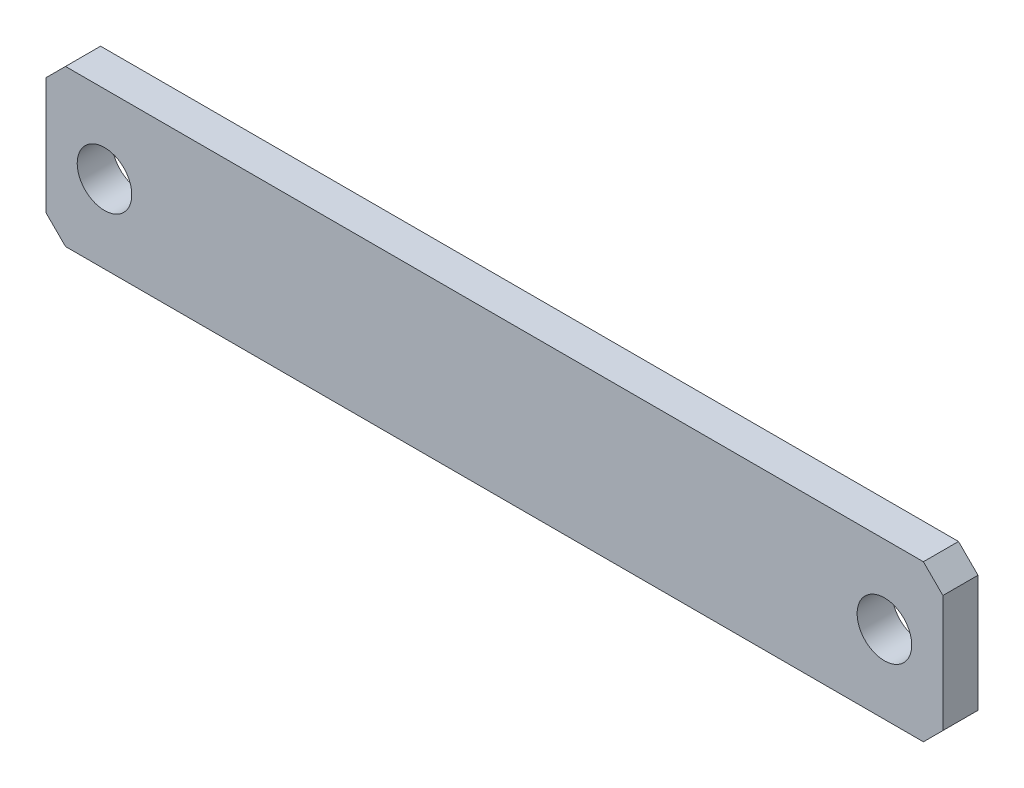
ISO-10303-21;
HEADER;
FILE_DESCRIPTION(('STEP AP214'),'2;1');
FILE_NAME('part.step','',(''),(''),'','','');
FILE_SCHEMA(('AUTOMOTIVE_DESIGN { 1 0 10303 214 1 1 1 1 }'));
ENDSEC;
DATA;
#1=APPLICATION_CONTEXT('core data for automotive mechanical design processes');
#2=APPLICATION_PROTOCOL_DEFINITION('international standard','automotive_design',2000,#1);
#3=PRODUCT_CONTEXT('',#1,'mechanical');
#4=PRODUCT('Part','Part','',(#3));
#5=PRODUCT_RELATED_PRODUCT_CATEGORY('part','',(#4));
#6=PRODUCT_DEFINITION_FORMATION('','',#4);
#7=PRODUCT_DEFINITION_CONTEXT('part definition',#1,'design');
#8=PRODUCT_DEFINITION('design','',#6,#7);
#9=PRODUCT_DEFINITION_SHAPE('','',#8);
#10=(LENGTH_UNIT() NAMED_UNIT(*) SI_UNIT(.MILLI.,.METRE.));
#11=(NAMED_UNIT(*) PLANE_ANGLE_UNIT() SI_UNIT($,.RADIAN.));
#12=(NAMED_UNIT(*) SI_UNIT($,.STERADIAN.) SOLID_ANGLE_UNIT());
#13=UNCERTAINTY_MEASURE_WITH_UNIT(LENGTH_MEASURE(1.E-05),#10,'distance_accuracy_value','');
#14=(GEOMETRIC_REPRESENTATION_CONTEXT(3) GLOBAL_UNCERTAINTY_ASSIGNED_CONTEXT((#13)) GLOBAL_UNIT_ASSIGNED_CONTEXT((#10,
#11,#12)) REPRESENTATION_CONTEXT('',''));
#15=CARTESIAN_POINT('',(0.,0.,0.));
#16=DIRECTION('',(0.,0.,1.));
#17=DIRECTION('',(1.,0.,0.));
#18=AXIS2_PLACEMENT_3D('',#15,#16,#17);
#19=CARTESIAN_POINT('',(0.,0.,0.));
#20=DIRECTION('',(0.,0.,-1.));
#21=DIRECTION('',(-1.,0.,0.));
#22=AXIS2_PLACEMENT_3D('',#19,#20,#21);
#23=PLANE('',#22);
#24=CARTESIAN_POINT('',(100.,0.,0.));
#25=DIRECTION('',(0.,0.,-1.));
#26=DIRECTION('',(-1.,0.,0.));
#27=AXIS2_PLACEMENT_3D('',#24,#25,#26);
#28=CIRCLE('',#27,7.00000000000001);
#29=CARTESIAN_POINT('',(93.,0.,0.));
#30=VERTEX_POINT('',#29);
#31=EDGE_CURVE('E106',#30,#30,#28,.F.);
#32=ORIENTED_EDGE('',*,*,#31,.T.);
#33=EDGE_LOOP('',(#32));
#34=FACE_BOUND('',#33,.T.);
#35=DIRECTION('',(-0.707106781186539,0.707106781186556,0.));
#36=VECTOR('',#35,1.);
#37=CARTESIAN_POINT('',(-115.,-15.,0.));
#38=LINE('',#37,#36);
#39=CARTESIAN_POINT('',(-110.,-20.,0.));
#40=VERTEX_POINT('',#39);
#41=CARTESIAN_POINT('',(-115.,-15.,0.));
#42=VERTEX_POINT('',#41);
#43=EDGE_CURVE('E125',#40,#42,#38,.T.);
#44=ORIENTED_EDGE('',*,*,#43,.T.);
#45=DIRECTION('',(0.,1.,0.));
#46=VECTOR('',#45,1.);
#47=CARTESIAN_POINT('',(-115.,-15.,0.));
#48=LINE('',#47,#46);
#49=CARTESIAN_POINT('',(-115.,15.,0.));
#50=VERTEX_POINT('',#49);
#51=EDGE_CURVE('E120',#42,#50,#48,.T.);
#52=ORIENTED_EDGE('',*,*,#51,.T.);
#53=DIRECTION('',(0.707106781186539,0.707106781186556,0.));
#54=VECTOR('',#53,1.);
#55=CARTESIAN_POINT('',(-115.,15.,0.));
#56=LINE('',#55,#54);
#57=CARTESIAN_POINT('',(-110.,20.,0.));
#58=VERTEX_POINT('',#57);
#59=EDGE_CURVE('E84',#50,#58,#56,.T.);
#60=ORIENTED_EDGE('',*,*,#59,.T.);
#61=DIRECTION('',(1.,0.,0.));
#62=VECTOR('',#61,1.);
#63=CARTESIAN_POINT('',(-110.,20.,0.));
#64=LINE('',#63,#62);
#65=CARTESIAN_POINT('',(110.,20.,0.));
#66=VERTEX_POINT('',#65);
#67=EDGE_CURVE('E82',#58,#66,#64,.T.);
#68=ORIENTED_EDGE('',*,*,#67,.T.);
#69=DIRECTION('',(0.707106781186556,-0.707106781186539,0.));
#70=VECTOR('',#69,1.);
#71=CARTESIAN_POINT('',(110.,20.,0.));
#72=LINE('',#71,#70);
#73=CARTESIAN_POINT('',(115.,15.,0.));
#74=VERTEX_POINT('',#73);
#75=EDGE_CURVE('E79',#66,#74,#72,.T.);
#76=ORIENTED_EDGE('',*,*,#75,.T.);
#77=DIRECTION('',(0.,1.,0.));
#78=VECTOR('',#77,1.);
#79=CARTESIAN_POINT('',(115.,15.,0.));
#80=LINE('',#79,#78);
#81=CARTESIAN_POINT('',(115.,-15.,0.));
#82=VERTEX_POINT('',#81);
#83=EDGE_CURVE('E140',#74,#82,#80,.F.);
#84=ORIENTED_EDGE('',*,*,#83,.T.);
#85=DIRECTION('',(-0.707106781186556,-0.707106781186539,0.));
#86=VECTOR('',#85,1.);
#87=CARTESIAN_POINT('',(110.,-20.,0.));
#88=LINE('',#87,#86);
#89=CARTESIAN_POINT('',(110.,-20.,0.));
#90=VERTEX_POINT('',#89);
#91=EDGE_CURVE('E135',#82,#90,#88,.T.);
#92=ORIENTED_EDGE('',*,*,#91,.T.);
#93=DIRECTION('',(1.,0.,0.));
#94=VECTOR('',#93,1.);
#95=CARTESIAN_POINT('',(-110.,-20.,0.));
#96=LINE('',#95,#94);
#97=EDGE_CURVE('E130',#90,#40,#96,.F.);
#98=ORIENTED_EDGE('',*,*,#97,.T.);
#99=EDGE_LOOP('',(#44,#52,#60,#68,#76,#84,#92,#98));
#100=FACE_BOUND('',#99,.T.);
#101=CARTESIAN_POINT('',(-100.,0.,0.));
#102=DIRECTION('',(0.,0.,-1.));
#103=DIRECTION('',(-1.,0.,0.));
#104=AXIS2_PLACEMENT_3D('',#101,#102,#103);
#105=CIRCLE('',#104,7.00000000000001);
#106=CARTESIAN_POINT('',(-107.,0.,0.));
#107=VERTEX_POINT('',#106);
#108=EDGE_CURVE('E19',#107,#107,#105,.F.);
#109=ORIENTED_EDGE('',*,*,#108,.T.);
#110=EDGE_LOOP('',(#109));
#111=FACE_BOUND('',#110,.T.);
#112=ADVANCED_FACE('F16',(#34,#100,#111),#23,.T.);
#113=CARTESIAN_POINT('',(-110.,20.,9.));
#114=DIRECTION('',(0.,-1.,0.));
#115=DIRECTION('',(0.,0.,-1.));
#116=AXIS2_PLACEMENT_3D('',#113,#114,#115);
#117=PLANE('',#116);
#118=DIRECTION('',(0.,0.,1.));
#119=VECTOR('',#118,1.);
#120=CARTESIAN_POINT('',(-110.,20.,9.));
#121=LINE('',#120,#119);
#122=CARTESIAN_POINT('',(-110.,20.,9.));
#123=VERTEX_POINT('',#122);
#124=EDGE_CURVE('E115',#58,#123,#121,.T.);
#125=ORIENTED_EDGE('',*,*,#124,.T.);
#126=DIRECTION('',(-1.,0.,0.));
#127=VECTOR('',#126,1.);
#128=CARTESIAN_POINT('',(0.,20.,9.));
#129=LINE('',#128,#127);
#130=CARTESIAN_POINT('',(110.,20.,9.));
#131=VERTEX_POINT('',#130);
#132=EDGE_CURVE('E100',#123,#131,#129,.F.);
#133=ORIENTED_EDGE('',*,*,#132,.T.);
#134=DIRECTION('',(0.,0.,1.));
#135=VECTOR('',#134,1.);
#136=CARTESIAN_POINT('',(110.,20.,9.));
#137=LINE('',#136,#135);
#138=EDGE_CURVE('E89',#131,#66,#137,.F.);
#139=ORIENTED_EDGE('',*,*,#138,.T.);
#140=ORIENTED_EDGE('',*,*,#67,.F.);
#141=EDGE_LOOP('',(#125,#133,#139,#140));
#142=FACE_BOUND('',#141,.T.);
#143=ADVANCED_FACE('F99',(#142),#117,.F.);
#144=CARTESIAN_POINT('',(110.,20.,9.));
#145=DIRECTION('',(-0.707106781186539,-0.707106781186556,0.));
#146=DIRECTION('',(0.707106781186556,-0.707106781186539,0.));
#147=AXIS2_PLACEMENT_3D('',#144,#145,#146);
#148=PLANE('',#147);
#149=ORIENTED_EDGE('',*,*,#138,.F.);
#150=DIRECTION('',(0.707106781186556,-0.707106781186539,0.));
#151=VECTOR('',#150,1.);
#152=CARTESIAN_POINT('',(110.,20.,9.));
#153=LINE('',#152,#151);
#154=CARTESIAN_POINT('',(115.,15.,9.));
#155=VERTEX_POINT('',#154);
#156=EDGE_CURVE('E110',#131,#155,#153,.T.);
#157=ORIENTED_EDGE('',*,*,#156,.T.);
#158=DIRECTION('',(0.,0.,1.));
#159=VECTOR('',#158,1.);
#160=CARTESIAN_POINT('',(115.,15.,9.));
#161=LINE('',#160,#159);
#162=EDGE_CURVE('E96',#155,#74,#161,.F.);
#163=ORIENTED_EDGE('',*,*,#162,.T.);
#164=ORIENTED_EDGE('',*,*,#75,.F.);
#165=EDGE_LOOP('',(#149,#157,#163,#164));
#166=FACE_BOUND('',#165,.T.);
#167=ADVANCED_FACE('F93',(#166),#148,.F.);
#168=CARTESIAN_POINT('',(115.,15.,9.));
#169=DIRECTION('',(-1.,0.,0.));
#170=DIRECTION('',(0.,0.,1.));
#171=AXIS2_PLACEMENT_3D('',#168,#169,#170);
#172=PLANE('',#171);
#173=ORIENTED_EDGE('',*,*,#162,.F.);
#174=DIRECTION('',(0.,1.,0.));
#175=VECTOR('',#174,1.);
#176=CARTESIAN_POINT('',(115.,0.,9.));
#177=LINE('',#176,#175);
#178=CARTESIAN_POINT('',(115.,-15.,9.));
#179=VERTEX_POINT('',#178);
#180=EDGE_CURVE('E151',#155,#179,#177,.F.);
#181=ORIENTED_EDGE('',*,*,#180,.T.);
#182=DIRECTION('',(0.,0.,1.));
#183=VECTOR('',#182,1.);
#184=CARTESIAN_POINT('',(115.,-15.,9.));
#185=LINE('',#184,#183);
#186=EDGE_CURVE('E137',#179,#82,#185,.F.);
#187=ORIENTED_EDGE('',*,*,#186,.T.);
#188=ORIENTED_EDGE('',*,*,#83,.F.);
#189=EDGE_LOOP('',(#173,#181,#187,#188));
#190=FACE_BOUND('',#189,.T.);
#191=ADVANCED_FACE('F149',(#190),#172,.F.);
#192=CARTESIAN_POINT('',(110.,-20.,9.));
#193=DIRECTION('',(-0.707106781186539,0.707106781186556,0.));
#194=DIRECTION('',(-0.707106781186556,-0.707106781186539,0.));
#195=AXIS2_PLACEMENT_3D('',#192,#193,#194);
#196=PLANE('',#195);
#197=ORIENTED_EDGE('',*,*,#186,.F.);
#198=DIRECTION('',(-0.707106781186556,-0.707106781186539,0.));
#199=VECTOR('',#198,1.);
#200=CARTESIAN_POINT('',(115.,-15.,9.));
#201=LINE('',#200,#199);
#202=CARTESIAN_POINT('',(110.,-20.,9.));
#203=VERTEX_POINT('',#202);
#204=EDGE_CURVE('E153',#179,#203,#201,.T.);
#205=ORIENTED_EDGE('',*,*,#204,.T.);
#206=DIRECTION('',(0.,0.,1.));
#207=VECTOR('',#206,1.);
#208=CARTESIAN_POINT('',(110.,-20.,9.));
#209=LINE('',#208,#207);
#210=EDGE_CURVE('E132',#203,#90,#209,.F.);
#211=ORIENTED_EDGE('',*,*,#210,.T.);
#212=ORIENTED_EDGE('',*,*,#91,.F.);
#213=EDGE_LOOP('',(#197,#205,#211,#212));
#214=FACE_BOUND('',#213,.T.);
#215=ADVANCED_FACE('F145',(#214),#196,.F.);
#216=CARTESIAN_POINT('',(-110.,-20.,9.));
#217=DIRECTION('',(0.,1.,0.));
#218=DIRECTION('',(0.,0.,1.));
#219=AXIS2_PLACEMENT_3D('',#216,#217,#218);
#220=PLANE('',#219);
#221=ORIENTED_EDGE('',*,*,#210,.F.);
#222=DIRECTION('',(-1.,0.,0.));
#223=VECTOR('',#222,1.);
#224=CARTESIAN_POINT('',(0.,-20.,9.));
#225=LINE('',#224,#223);
#226=CARTESIAN_POINT('',(-110.,-20.,9.));
#227=VERTEX_POINT('',#226);
#228=EDGE_CURVE('E155',#203,#227,#225,.T.);
#229=ORIENTED_EDGE('',*,*,#228,.T.);
#230=DIRECTION('',(0.,0.,1.));
#231=VECTOR('',#230,1.);
#232=CARTESIAN_POINT('',(-110.,-20.,9.));
#233=LINE('',#232,#231);
#234=EDGE_CURVE('E127',#227,#40,#233,.F.);
#235=ORIENTED_EDGE('',*,*,#234,.T.);
#236=ORIENTED_EDGE('',*,*,#97,.F.);
#237=EDGE_LOOP('',(#221,#229,#235,#236));
#238=FACE_BOUND('',#237,.T.);
#239=ADVANCED_FACE('F178',(#238),#220,.F.);
#240=CARTESIAN_POINT('',(-115.,-15.,9.));
#241=DIRECTION('',(0.707106781186556,0.707106781186539,0.));
#242=DIRECTION('',(-0.707106781186539,0.707106781186556,0.));
#243=AXIS2_PLACEMENT_3D('',#240,#241,#242);
#244=PLANE('',#243);
#245=ORIENTED_EDGE('',*,*,#234,.F.);
#246=DIRECTION('',(-0.707106781186539,0.707106781186556,0.));
#247=VECTOR('',#246,1.);
#248=CARTESIAN_POINT('',(-110.,-20.,9.));
#249=LINE('',#248,#247);
#250=CARTESIAN_POINT('',(-115.,-15.,9.));
#251=VERTEX_POINT('',#250);
#252=EDGE_CURVE('E160',#227,#251,#249,.T.);
#253=ORIENTED_EDGE('',*,*,#252,.T.);
#254=DIRECTION('',(0.,0.,-1.));
#255=VECTOR('',#254,1.);
#256=CARTESIAN_POINT('',(-115.,-15.,9.));
#257=LINE('',#256,#255);
#258=EDGE_CURVE('E122',#251,#42,#257,.T.);
#259=ORIENTED_EDGE('',*,*,#258,.T.);
#260=ORIENTED_EDGE('',*,*,#43,.F.);
#261=EDGE_LOOP('',(#245,#253,#259,#260));
#262=FACE_BOUND('',#261,.T.);
#263=ADVANCED_FACE('F175',(#262),#244,.F.);
#264=CARTESIAN_POINT('',(-115.,-15.,9.));
#265=DIRECTION('',(1.,0.,0.));
#266=DIRECTION('',(0.,0.,-1.));
#267=AXIS2_PLACEMENT_3D('',#264,#265,#266);
#268=PLANE('',#267);
#269=ORIENTED_EDGE('',*,*,#258,.F.);
#270=DIRECTION('',(0.,1.,0.));
#271=VECTOR('',#270,1.);
#272=CARTESIAN_POINT('',(-115.,0.,9.));
#273=LINE('',#272,#271);
#274=CARTESIAN_POINT('',(-115.,15.,9.));
#275=VERTEX_POINT('',#274);
#276=EDGE_CURVE('E163',#251,#275,#273,.T.);
#277=ORIENTED_EDGE('',*,*,#276,.T.);
#278=DIRECTION('',(0.,0.,1.));
#279=VECTOR('',#278,1.);
#280=CARTESIAN_POINT('',(-115.,15.,9.));
#281=LINE('',#280,#279);
#282=EDGE_CURVE('E34',#275,#50,#281,.F.);
#283=ORIENTED_EDGE('',*,*,#282,.T.);
#284=ORIENTED_EDGE('',*,*,#51,.F.);
#285=EDGE_LOOP('',(#269,#277,#283,#284));
#286=FACE_BOUND('',#285,.T.);
#287=ADVANCED_FACE('F171',(#286),#268,.F.);
#288=CARTESIAN_POINT('',(-115.,15.,9.));
#289=DIRECTION('',(0.707106781186556,-0.707106781186539,0.));
#290=DIRECTION('',(0.707106781186539,0.707106781186556,0.));
#291=AXIS2_PLACEMENT_3D('',#288,#289,#290);
#292=PLANE('',#291);
#293=ORIENTED_EDGE('',*,*,#282,.F.);
#294=DIRECTION('',(0.707106781186539,0.707106781186556,0.));
#295=VECTOR('',#294,1.);
#296=CARTESIAN_POINT('',(-115.,15.,9.));
#297=LINE('',#296,#295);
#298=EDGE_CURVE('E105',#275,#123,#297,.T.);
#299=ORIENTED_EDGE('',*,*,#298,.T.);
#300=ORIENTED_EDGE('',*,*,#124,.F.);
#301=ORIENTED_EDGE('',*,*,#59,.F.);
#302=EDGE_LOOP('',(#293,#299,#300,#301));
#303=FACE_BOUND('',#302,.T.);
#304=ADVANCED_FACE('F166',(#303),#292,.F.);
#305=CARTESIAN_POINT('',(-100.,0.,9.));
#306=DIRECTION('',(0.,0.,-1.));
#307=DIRECTION('',(-1.,0.,0.));
#308=AXIS2_PLACEMENT_3D('',#305,#306,#307);
#309=CYLINDRICAL_SURFACE('',#308,7.00000000000001);
#310=ORIENTED_EDGE('',*,*,#108,.F.);
#311=EDGE_LOOP('',(#310));
#312=FACE_BOUND('',#311,.T.);
#313=CARTESIAN_POINT('',(-100.,0.,9.));
#314=DIRECTION('',(0.,0.,-1.));
#315=DIRECTION('',(-1.,0.,0.));
#316=AXIS2_PLACEMENT_3D('',#313,#314,#315);
#317=CIRCLE('',#316,7.00000000000001);
#318=CARTESIAN_POINT('',(-107.,0.,9.));
#319=VERTEX_POINT('',#318);
#320=EDGE_CURVE('E25',#319,#319,#317,.F.);
#321=ORIENTED_EDGE('',*,*,#320,.T.);
#322=EDGE_LOOP('',(#321));
#323=FACE_BOUND('',#322,.T.);
#324=ADVANCED_FACE('F195',(#312,#323),#309,.F.);
#325=CARTESIAN_POINT('',(100.,0.,9.));
#326=DIRECTION('',(0.,0.,-1.));
#327=DIRECTION('',(-1.,0.,0.));
#328=AXIS2_PLACEMENT_3D('',#325,#326,#327);
#329=CYLINDRICAL_SURFACE('',#328,7.00000000000001);
#330=ORIENTED_EDGE('',*,*,#31,.F.);
#331=EDGE_LOOP('',(#330));
#332=FACE_BOUND('',#331,.T.);
#333=CARTESIAN_POINT('',(100.,0.,9.));
#334=DIRECTION('',(0.,0.,-1.));
#335=DIRECTION('',(-1.,0.,0.));
#336=AXIS2_PLACEMENT_3D('',#333,#334,#335);
#337=CIRCLE('',#336,7.00000000000001);
#338=CARTESIAN_POINT('',(93.,0.,9.));
#339=VERTEX_POINT('',#338);
#340=EDGE_CURVE('E11',#339,#339,#337,.F.);
#341=ORIENTED_EDGE('',*,*,#340,.T.);
#342=EDGE_LOOP('',(#341));
#343=FACE_BOUND('',#342,.T.);
#344=ADVANCED_FACE('F189',(#332,#343),#329,.F.);
#345=CARTESIAN_POINT('',(0.,0.,9.));
#346=DIRECTION('',(0.,0.,-1.));
#347=DIRECTION('',(-1.,0.,0.));
#348=AXIS2_PLACEMENT_3D('',#345,#346,#347);
#349=PLANE('',#348);
#350=ORIENTED_EDGE('',*,*,#340,.F.);
#351=EDGE_LOOP('',(#350));
#352=FACE_BOUND('',#351,.T.);
#353=ORIENTED_EDGE('',*,*,#320,.F.);
#354=EDGE_LOOP('',(#353));
#355=FACE_BOUND('',#354,.T.);
#356=ORIENTED_EDGE('',*,*,#276,.F.);
#357=ORIENTED_EDGE('',*,*,#252,.F.);
#358=ORIENTED_EDGE('',*,*,#228,.F.);
#359=ORIENTED_EDGE('',*,*,#204,.F.);
#360=ORIENTED_EDGE('',*,*,#180,.F.);
#361=ORIENTED_EDGE('',*,*,#156,.F.);
#362=ORIENTED_EDGE('',*,*,#132,.F.);
#363=ORIENTED_EDGE('',*,*,#298,.F.);
#364=EDGE_LOOP('',(#356,#357,#358,#359,#360,#361,#362,#363));
#365=FACE_BOUND('',#364,.T.);
#366=ADVANCED_FACE('F168',(#352,#355,#365),#349,.F.);
#367=CLOSED_SHELL('',(#112,#143,#167,#191,#215,#239,#263,#287,#304,#324,#344,#366));
#368=MANIFOLD_SOLID_BREP('B1',#367);
#369=ADVANCED_BREP_SHAPE_REPRESENTATION('',(#18,#368),#14);
#370=SHAPE_DEFINITION_REPRESENTATION(#9,#369);
ENDSEC;
END-ISO-10303-21;
